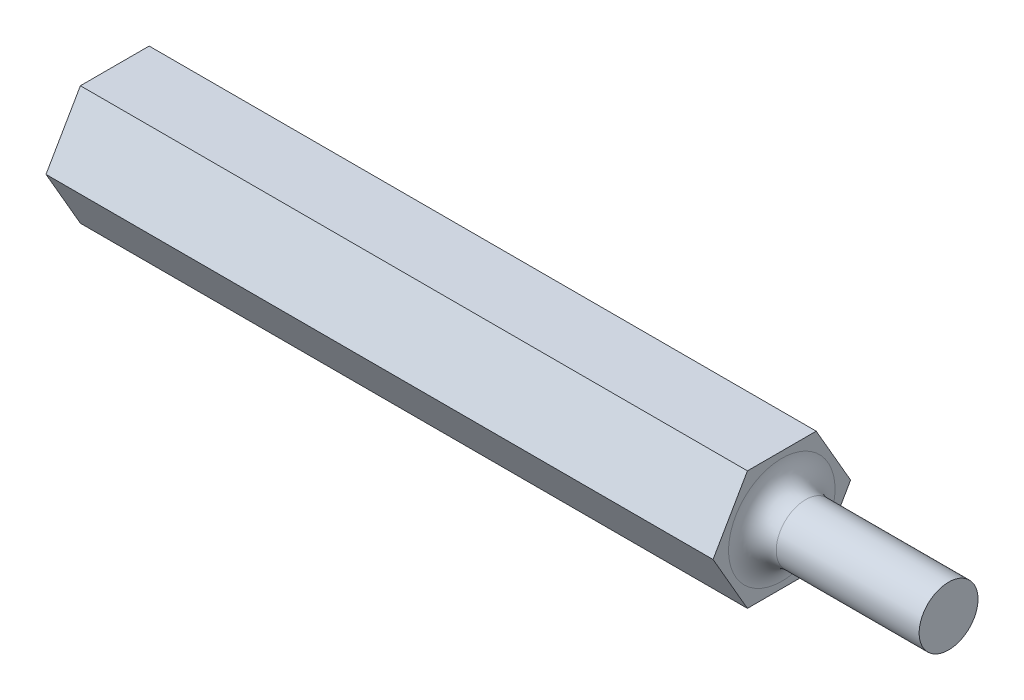
ISO-10303-21;
HEADER;
FILE_DESCRIPTION(('STEP AP214'),'2;1');
FILE_NAME('part.step','',(''),(''),'','','');
FILE_SCHEMA(('AUTOMOTIVE_DESIGN { 1 0 10303 214 1 1 1 1 }'));
ENDSEC;
DATA;
#1=APPLICATION_CONTEXT('core data for automotive mechanical design processes');
#2=APPLICATION_PROTOCOL_DEFINITION('international standard','automotive_design',2000,#1);
#3=PRODUCT_CONTEXT('',#1,'mechanical');
#4=PRODUCT('Part','Part','',(#3));
#5=PRODUCT_RELATED_PRODUCT_CATEGORY('part','',(#4));
#6=PRODUCT_DEFINITION_FORMATION('','',#4);
#7=PRODUCT_DEFINITION_CONTEXT('part definition',#1,'design');
#8=PRODUCT_DEFINITION('design','',#6,#7);
#9=PRODUCT_DEFINITION_SHAPE('','',#8);
#10=(LENGTH_UNIT() NAMED_UNIT(*) SI_UNIT(.MILLI.,.METRE.));
#11=(NAMED_UNIT(*) PLANE_ANGLE_UNIT() SI_UNIT($,.RADIAN.));
#12=(NAMED_UNIT(*) SI_UNIT($,.STERADIAN.) SOLID_ANGLE_UNIT());
#13=UNCERTAINTY_MEASURE_WITH_UNIT(LENGTH_MEASURE(1.E-05),#10,'distance_accuracy_value','');
#14=(GEOMETRIC_REPRESENTATION_CONTEXT(3) GLOBAL_UNCERTAINTY_ASSIGNED_CONTEXT((#13)) GLOBAL_UNIT_ASSIGNED_CONTEXT((#10,
#11,#12)) REPRESENTATION_CONTEXT('',''));
#15=CARTESIAN_POINT('',(0.,0.,0.));
#16=DIRECTION('',(0.,0.,1.));
#17=DIRECTION('',(1.,0.,0.));
#18=AXIS2_PLACEMENT_3D('',#15,#16,#17);
#19=CARTESIAN_POINT('',(88.9,-6.35,3.66617420935413));
#20=DIRECTION('',(0.,1.,0.));
#21=DIRECTION('',(0.,0.,1.));
#22=AXIS2_PLACEMENT_3D('',#19,#20,#21);
#23=PLANE('',#22);
#24=DIRECTION('',(0.,0.,-1.));
#25=VECTOR('',#24,1.);
#26=CARTESIAN_POINT('',(71.12,-6.35,3.66617420935413));
#27=LINE('',#26,#25);
#28=CARTESIAN_POINT('',(71.12,-6.35,3.66617420935412));
#29=VERTEX_POINT('',#28);
#30=CARTESIAN_POINT('',(71.12,-6.35,-3.66617420935412));
#31=VERTEX_POINT('',#30);
#32=EDGE_CURVE('E86',#29,#31,#27,.T.);
#33=ORIENTED_EDGE('',*,*,#32,.F.);
#34=DIRECTION('',(-1.,0.,0.));
#35=VECTOR('',#34,1.);
#36=CARTESIAN_POINT('',(88.9,-6.35,3.66617420935413));
#37=LINE('',#36,#35);
#38=CARTESIAN_POINT('',(0.,-6.35,3.66617420935413));
#39=VERTEX_POINT('',#38);
#40=EDGE_CURVE('E55',#29,#39,#37,.T.);
#41=ORIENTED_EDGE('',*,*,#40,.T.);
#42=DIRECTION('',(0.,0.,-1.));
#43=VECTOR('',#42,1.);
#44=CARTESIAN_POINT('',(0.,-6.35,3.66617420935413));
#45=LINE('',#44,#43);
#46=CARTESIAN_POINT('',(0.,-6.35,-3.66617420935412));
#47=VERTEX_POINT('',#46);
#48=EDGE_CURVE('E93',#39,#47,#45,.T.);
#49=ORIENTED_EDGE('',*,*,#48,.T.);
#50=DIRECTION('',(-1.,0.,0.));
#51=VECTOR('',#50,1.);
#52=CARTESIAN_POINT('',(88.9,-6.35,-3.66617420935412));
#53=LINE('',#52,#51);
#54=EDGE_CURVE('E90',#31,#47,#53,.T.);
#55=ORIENTED_EDGE('',*,*,#54,.F.);
#56=EDGE_LOOP('',(#33,#41,#49,#55));
#57=FACE_BOUND('',#56,.T.);
#58=ADVANCED_FACE('F32',(#57),#23,.F.);
#59=CARTESIAN_POINT('',(88.9,-6.35,-3.66617420935412));
#60=DIRECTION('',(0.,0.5,0.866025403784438));
#61=DIRECTION('',(0.,-0.866025403784438,0.5));
#62=AXIS2_PLACEMENT_3D('',#59,#60,#61);
#63=PLANE('',#62);
#64=DIRECTION('',(0.,0.866025403784438,-0.5));
#65=VECTOR('',#64,1.);
#66=CARTESIAN_POINT('',(71.12,-6.35,-3.66617420935412));
#67=LINE('',#66,#65);
#68=CARTESIAN_POINT('',(71.12,0.,-7.33234841870825));
#69=VERTEX_POINT('',#68);
#70=EDGE_CURVE('E94',#31,#69,#67,.T.);
#71=ORIENTED_EDGE('',*,*,#70,.F.);
#72=ORIENTED_EDGE('',*,*,#54,.T.);
#73=DIRECTION('',(0.,0.866025403784438,-0.5));
#74=VECTOR('',#73,1.);
#75=CARTESIAN_POINT('',(0.,-6.35,-3.66617420935412));
#76=LINE('',#75,#74);
#77=CARTESIAN_POINT('',(0.,0.,-7.33234841870825));
#78=VERTEX_POINT('',#77);
#79=EDGE_CURVE('E224',#47,#78,#76,.T.);
#80=ORIENTED_EDGE('',*,*,#79,.T.);
#81=DIRECTION('',(-1.,0.,0.));
#82=VECTOR('',#81,1.);
#83=CARTESIAN_POINT('',(88.9,0.,-7.33234841870825));
#84=LINE('',#83,#82);
#85=EDGE_CURVE('E111',#69,#78,#84,.T.);
#86=ORIENTED_EDGE('',*,*,#85,.F.);
#87=EDGE_LOOP('',(#71,#72,#80,#86));
#88=FACE_BOUND('',#87,.T.);
#89=ADVANCED_FACE('F129',(#88),#63,.F.);
#90=CARTESIAN_POINT('',(88.9,0.,-7.33234841870825));
#91=DIRECTION('',(0.,-0.5,0.866025403784438));
#92=DIRECTION('',(0.,-0.866025403784439,-0.5));
#93=AXIS2_PLACEMENT_3D('',#90,#91,#92);
#94=PLANE('',#93);
#95=DIRECTION('',(0.,0.866025403784439,0.5));
#96=VECTOR('',#95,1.);
#97=CARTESIAN_POINT('',(71.12,0.,-7.33234841870825));
#98=LINE('',#97,#96);
#99=CARTESIAN_POINT('',(71.12,6.35,-3.66617420935412));
#100=VERTEX_POINT('',#99);
#101=EDGE_CURVE('E242',#69,#100,#98,.T.);
#102=ORIENTED_EDGE('',*,*,#101,.F.);
#103=ORIENTED_EDGE('',*,*,#85,.T.);
#104=DIRECTION('',(0.,0.866025403784439,0.5));
#105=VECTOR('',#104,1.);
#106=CARTESIAN_POINT('',(0.,0.,-7.33234841870825));
#107=LINE('',#106,#105);
#108=CARTESIAN_POINT('',(0.,6.35,-3.66617420935412));
#109=VERTEX_POINT('',#108);
#110=EDGE_CURVE('E226',#78,#109,#107,.T.);
#111=ORIENTED_EDGE('',*,*,#110,.T.);
#112=DIRECTION('',(-1.,0.,0.));
#113=VECTOR('',#112,1.);
#114=CARTESIAN_POINT('',(88.9,6.35,-3.66617420935412));
#115=LINE('',#114,#113);
#116=EDGE_CURVE('E109',#100,#109,#115,.T.);
#117=ORIENTED_EDGE('',*,*,#116,.F.);
#118=EDGE_LOOP('',(#102,#103,#111,#117));
#119=FACE_BOUND('',#118,.T.);
#120=ADVANCED_FACE('F133',(#119),#94,.F.);
#121=CARTESIAN_POINT('',(88.9,6.35,-3.66617420935412));
#122=DIRECTION('',(0.,-1.,0.));
#123=DIRECTION('',(0.,0.,-1.));
#124=AXIS2_PLACEMENT_3D('',#121,#122,#123);
#125=PLANE('',#124);
#126=DIRECTION('',(0.,0.,1.));
#127=VECTOR('',#126,1.);
#128=CARTESIAN_POINT('',(71.12,6.35,-3.66617420935412));
#129=LINE('',#128,#127);
#130=CARTESIAN_POINT('',(71.12,6.35,3.66617420935412));
#131=VERTEX_POINT('',#130);
#132=EDGE_CURVE('E239',#100,#131,#129,.T.);
#133=ORIENTED_EDGE('',*,*,#132,.F.);
#134=ORIENTED_EDGE('',*,*,#116,.T.);
#135=DIRECTION('',(0.,0.,1.));
#136=VECTOR('',#135,1.);
#137=CARTESIAN_POINT('',(0.,6.35,-3.66617420935412));
#138=LINE('',#137,#136);
#139=CARTESIAN_POINT('',(0.,6.35,3.66617420935412));
#140=VERTEX_POINT('',#139);
#141=EDGE_CURVE('E232',#109,#140,#138,.T.);
#142=ORIENTED_EDGE('',*,*,#141,.T.);
#143=DIRECTION('',(-1.,0.,0.));
#144=VECTOR('',#143,1.);
#145=CARTESIAN_POINT('',(88.9,6.35,3.66617420935412));
#146=LINE('',#145,#144);
#147=EDGE_CURVE('E102',#131,#140,#146,.T.);
#148=ORIENTED_EDGE('',*,*,#147,.F.);
#149=EDGE_LOOP('',(#133,#134,#142,#148));
#150=FACE_BOUND('',#149,.T.);
#151=ADVANCED_FACE('F139',(#150),#125,.F.);
#152=CARTESIAN_POINT('',(88.9,6.35,3.66617420935412));
#153=DIRECTION('',(0.,-0.5,-0.866025403784438));
#154=DIRECTION('',(0.,0.866025403784438,-0.5));
#155=AXIS2_PLACEMENT_3D('',#152,#153,#154);
#156=PLANE('',#155);
#157=DIRECTION('',(0.,-0.866025403784438,0.5));
#158=VECTOR('',#157,1.);
#159=CARTESIAN_POINT('',(71.12,6.35,3.66617420935412));
#160=LINE('',#159,#158);
#161=CARTESIAN_POINT('',(71.12,0.,7.33234841870825));
#162=VERTEX_POINT('',#161);
#163=EDGE_CURVE('E47',#131,#162,#160,.T.);
#164=ORIENTED_EDGE('',*,*,#163,.F.);
#165=ORIENTED_EDGE('',*,*,#147,.T.);
#166=DIRECTION('',(0.,-0.866025403784438,0.5));
#167=VECTOR('',#166,1.);
#168=CARTESIAN_POINT('',(0.,6.35,3.66617420935412));
#169=LINE('',#168,#167);
#170=CARTESIAN_POINT('',(0.,0.,7.33234841870825));
#171=VERTEX_POINT('',#170);
#172=EDGE_CURVE('E104',#140,#171,#169,.T.);
#173=ORIENTED_EDGE('',*,*,#172,.T.);
#174=DIRECTION('',(-1.,0.,0.));
#175=VECTOR('',#174,1.);
#176=CARTESIAN_POINT('',(88.9,0.,7.33234841870825));
#177=LINE('',#176,#175);
#178=EDGE_CURVE('E100',#162,#171,#177,.T.);
#179=ORIENTED_EDGE('',*,*,#178,.F.);
#180=EDGE_LOOP('',(#164,#165,#173,#179));
#181=FACE_BOUND('',#180,.T.);
#182=ADVANCED_FACE('F143',(#181),#156,.F.);
#183=CARTESIAN_POINT('',(88.9,0.,7.33234841870825));
#184=DIRECTION('',(0.,0.5,-0.866025403784439));
#185=DIRECTION('',(0.,0.866025403784439,0.5));
#186=AXIS2_PLACEMENT_3D('',#183,#184,#185);
#187=PLANE('',#186);
#188=DIRECTION('',(0.,-0.866025403784439,-0.5));
#189=VECTOR('',#188,1.);
#190=CARTESIAN_POINT('',(71.12,0.,7.33234841870825));
#191=LINE('',#190,#189);
#192=EDGE_CURVE('E84',#162,#29,#191,.T.);
#193=ORIENTED_EDGE('',*,*,#192,.F.);
#194=ORIENTED_EDGE('',*,*,#178,.T.);
#195=DIRECTION('',(0.,-0.866025403784439,-0.5));
#196=VECTOR('',#195,1.);
#197=CARTESIAN_POINT('',(0.,0.,7.33234841870825));
#198=LINE('',#197,#196);
#199=EDGE_CURVE('E98',#171,#39,#198,.T.);
#200=ORIENTED_EDGE('',*,*,#199,.T.);
#201=ORIENTED_EDGE('',*,*,#40,.F.);
#202=EDGE_LOOP('',(#193,#194,#200,#201));
#203=FACE_BOUND('',#202,.T.);
#204=ADVANCED_FACE('F96',(#203),#187,.F.);
#205=CARTESIAN_POINT('',(0.,0.,0.));
#206=DIRECTION('',(1.,0.,0.));
#207=DIRECTION('',(0.,0.,-1.));
#208=AXIS2_PLACEMENT_3D('',#205,#206,#207);
#209=PLANE('',#208);
#210=ORIENTED_EDGE('',*,*,#48,.F.);
#211=ORIENTED_EDGE('',*,*,#199,.F.);
#212=ORIENTED_EDGE('',*,*,#172,.F.);
#213=ORIENTED_EDGE('',*,*,#141,.F.);
#214=ORIENTED_EDGE('',*,*,#110,.F.);
#215=ORIENTED_EDGE('',*,*,#79,.F.);
#216=EDGE_LOOP('',(#210,#211,#212,#213,#214,#215));
#217=FACE_BOUND('',#216,.T.);
#218=ADVANCED_FACE('F150',(#217),#209,.F.);
#219=CARTESIAN_POINT('',(71.12,0.,0.));
#220=DIRECTION('',(1.,0.,0.));
#221=DIRECTION('',(0.,0.,-1.));
#222=AXIS2_PLACEMENT_3D('',#219,#220,#221);
#223=PLANE('',#222);
#224=CARTESIAN_POINT('',(71.12,0.,0.));
#225=DIRECTION('',(1.,0.,0.));
#226=DIRECTION('',(0.,0.,-1.));
#227=AXIS2_PLACEMENT_3D('',#224,#225,#226);
#228=CIRCLE('',#227,5.6769);
#229=CARTESIAN_POINT('',(71.12,0.,-5.6769));
#230=VERTEX_POINT('',#229);
#231=EDGE_CURVE('E11',#230,#230,#228,.F.);
#232=ORIENTED_EDGE('',*,*,#231,.T.);
#233=EDGE_LOOP('',(#232));
#234=FACE_BOUND('',#233,.T.);
#235=ORIENTED_EDGE('',*,*,#32,.T.);
#236=ORIENTED_EDGE('',*,*,#70,.T.);
#237=ORIENTED_EDGE('',*,*,#101,.T.);
#238=ORIENTED_EDGE('',*,*,#132,.T.);
#239=ORIENTED_EDGE('',*,*,#163,.T.);
#240=ORIENTED_EDGE('',*,*,#192,.T.);
#241=EDGE_LOOP('',(#235,#236,#237,#238,#239,#240));
#242=FACE_BOUND('',#241,.T.);
#243=ADVANCED_FACE('F85',(#234,#242),#223,.T.);
#244=CARTESIAN_POINT('',(71.12,0.,0.));
#245=DIRECTION('',(1.,0.,0.));
#246=DIRECTION('',(0.,0.,-1.));
#247=AXIS2_PLACEMENT_3D('',#244,#245,#246);
#248=CYLINDRICAL_SURFACE('',#247,3.1369);
#249=CARTESIAN_POINT('',(73.66,0.,0.));
#250=DIRECTION('',(1.,0.,0.));
#251=DIRECTION('',(0.,0.,-1.));
#252=AXIS2_PLACEMENT_3D('',#249,#250,#251);
#253=CIRCLE('',#252,3.1369);
#254=CARTESIAN_POINT('',(73.66,0.,-3.1369));
#255=VERTEX_POINT('',#254);
#256=EDGE_CURVE('E40',#255,#255,#253,.T.);
#257=ORIENTED_EDGE('',*,*,#256,.T.);
#258=EDGE_LOOP('',(#257));
#259=FACE_BOUND('',#258,.T.);
#260=CARTESIAN_POINT('',(88.9,0.,0.));
#261=DIRECTION('',(1.,0.,0.));
#262=DIRECTION('',(0.,0.,-1.));
#263=AXIS2_PLACEMENT_3D('',#260,#261,#262);
#264=CIRCLE('',#263,3.1369);
#265=CARTESIAN_POINT('',(88.9,0.,-3.1369));
#266=VERTEX_POINT('',#265);
#267=EDGE_CURVE('E247',#266,#266,#264,.T.);
#268=ORIENTED_EDGE('',*,*,#267,.F.);
#269=EDGE_LOOP('',(#268));
#270=FACE_BOUND('',#269,.T.);
#271=ADVANCED_FACE('F116',(#259,#270),#248,.T.);
#272=CARTESIAN_POINT('',(88.9,0.,0.));
#273=DIRECTION('',(1.,0.,0.));
#274=DIRECTION('',(0.,0.,-1.));
#275=AXIS2_PLACEMENT_3D('',#272,#273,#274);
#276=PLANE('',#275);
#277=ORIENTED_EDGE('',*,*,#267,.T.);
#278=EDGE_LOOP('',(#277));
#279=FACE_BOUND('',#278,.T.);
#280=ADVANCED_FACE('F120',(#279),#276,.T.);
#281=CARTESIAN_POINT('',(73.66,0.,0.));
#282=DIRECTION('',(1.,0.,0.));
#283=DIRECTION('',(0.,0.,-1.));
#284=AXIS2_PLACEMENT_3D('',#281,#282,#283);
#285=TOROIDAL_SURFACE('',#284,5.6769,2.54);
#286=ORIENTED_EDGE('',*,*,#231,.F.);
#287=EDGE_LOOP('',(#286));
#288=FACE_BOUND('',#287,.T.);
#289=ORIENTED_EDGE('',*,*,#256,.F.);
#290=EDGE_LOOP('',(#289));
#291=FACE_BOUND('',#290,.T.);
#292=ADVANCED_FACE('F34',(#288,#291),#285,.F.);
#293=CLOSED_SHELL('',(#58,#89,#120,#151,#182,#204,#218,#243,#271,#280,#292));
#294=MANIFOLD_SOLID_BREP('B2',#293);
#295=ADVANCED_BREP_SHAPE_REPRESENTATION('',(#18,#294),#14);
#296=SHAPE_DEFINITION_REPRESENTATION(#9,#295);
ENDSEC;
END-ISO-10303-21;
